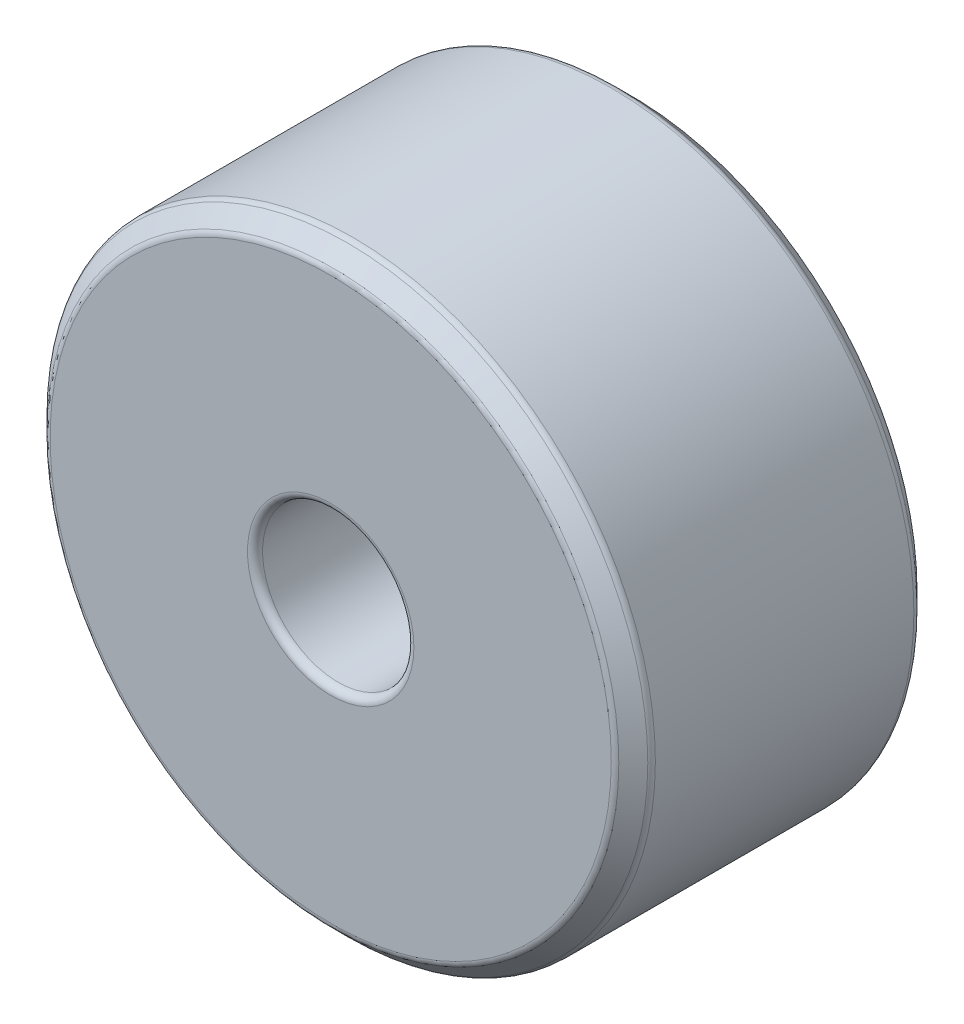
ISO-10303-21;
HEADER;
FILE_DESCRIPTION(('STEP AP214'),'2;1');
FILE_NAME('part.step','',(''),(''),'','','');
FILE_SCHEMA(('AUTOMOTIVE_DESIGN { 1 0 10303 214 1 1 1 1 }'));
ENDSEC;
DATA;
#1=APPLICATION_CONTEXT('core data for automotive mechanical design processes');
#2=APPLICATION_PROTOCOL_DEFINITION('international standard','automotive_design',2000,#1);
#3=PRODUCT_CONTEXT('',#1,'mechanical');
#4=PRODUCT('Part','Part','',(#3));
#5=PRODUCT_RELATED_PRODUCT_CATEGORY('part','',(#4));
#6=PRODUCT_DEFINITION_FORMATION('','',#4);
#7=PRODUCT_DEFINITION_CONTEXT('part definition',#1,'design');
#8=PRODUCT_DEFINITION('design','',#6,#7);
#9=PRODUCT_DEFINITION_SHAPE('','',#8);
#10=(LENGTH_UNIT() NAMED_UNIT(*) SI_UNIT(.MILLI.,.METRE.));
#11=(NAMED_UNIT(*) PLANE_ANGLE_UNIT() SI_UNIT($,.RADIAN.));
#12=(NAMED_UNIT(*) SI_UNIT($,.STERADIAN.) SOLID_ANGLE_UNIT());
#13=UNCERTAINTY_MEASURE_WITH_UNIT(LENGTH_MEASURE(1.E-05),#10,'distance_accuracy_value','');
#14=(GEOMETRIC_REPRESENTATION_CONTEXT(3) GLOBAL_UNCERTAINTY_ASSIGNED_CONTEXT((#13)) GLOBAL_UNIT_ASSIGNED_CONTEXT((#10,
#11,#12)) REPRESENTATION_CONTEXT('',''));
#15=CARTESIAN_POINT('',(0.,0.,0.));
#16=DIRECTION('',(0.,0.,1.));
#17=DIRECTION('',(1.,0.,0.));
#18=AXIS2_PLACEMENT_3D('',#15,#16,#17);
#19=CARTESIAN_POINT('',(0.,0.,4.));
#20=DIRECTION('',(0.,0.,1.));
#21=DIRECTION('',(1.,0.,0.));
#22=AXIS2_PLACEMENT_3D('',#19,#20,#21);
#23=PLANE('',#22);
#24=CARTESIAN_POINT('',(0.,0.,4.));
#25=DIRECTION('',(0.,0.,1.));
#26=DIRECTION('',(1.,0.,0.));
#27=AXIS2_PLACEMENT_3D('',#24,#25,#26);
#28=CIRCLE('',#27,3.70857864376269);
#29=CARTESIAN_POINT('',(3.70857864376269,0.,4.));
#30=VERTEX_POINT('',#29);
#31=EDGE_CURVE('E52',#30,#30,#28,.T.);
#32=ORIENTED_EDGE('',*,*,#31,.T.);
#33=EDGE_LOOP('',(#32));
#34=FACE_BOUND('',#33,.T.);
#35=CARTESIAN_POINT('',(0.,0.,4.));
#36=DIRECTION('',(0.,0.,1.));
#37=DIRECTION('',(1.,0.,0.));
#38=AXIS2_PLACEMENT_3D('',#35,#36,#37);
#39=CIRCLE('',#38,1.1);
#40=CARTESIAN_POINT('',(1.1,0.,4.));
#41=VERTEX_POINT('',#40);
#42=EDGE_CURVE('E55',#41,#41,#39,.F.);
#43=ORIENTED_EDGE('',*,*,#42,.T.);
#44=EDGE_LOOP('',(#43));
#45=FACE_BOUND('',#44,.T.);
#46=ADVANCED_FACE('F32',(#34,#45),#23,.T.);
#47=CARTESIAN_POINT('',(0.,0.,0.));
#48=DIRECTION('',(0.,0.,1.));
#49=DIRECTION('',(1.,0.,0.));
#50=AXIS2_PLACEMENT_3D('',#47,#48,#49);
#51=PLANE('',#50);
#52=CARTESIAN_POINT('',(0.,0.,0.));
#53=DIRECTION('',(0.,0.,1.));
#54=DIRECTION('',(1.,0.,0.));
#55=AXIS2_PLACEMENT_3D('',#52,#53,#54);
#56=CIRCLE('',#55,3.70857864376269);
#57=CARTESIAN_POINT('',(3.70857864376269,0.,0.));
#58=VERTEX_POINT('',#57);
#59=EDGE_CURVE('E70',#58,#58,#56,.F.);
#60=ORIENTED_EDGE('',*,*,#59,.T.);
#61=EDGE_LOOP('',(#60));
#62=FACE_BOUND('',#61,.T.);
#63=CARTESIAN_POINT('',(0.,0.,0.));
#64=DIRECTION('',(0.,0.,1.));
#65=DIRECTION('',(1.,0.,0.));
#66=AXIS2_PLACEMENT_3D('',#63,#64,#65);
#67=CIRCLE('',#66,1.1);
#68=CARTESIAN_POINT('',(1.1,0.,0.));
#69=VERTEX_POINT('',#68);
#70=EDGE_CURVE('E73',#69,#69,#67,.T.);
#71=ORIENTED_EDGE('',*,*,#70,.T.);
#72=EDGE_LOOP('',(#71));
#73=FACE_BOUND('',#72,.T.);
#74=ADVANCED_FACE('F77',(#62,#73),#51,.F.);
#75=CARTESIAN_POINT('',(0.,0.,4.));
#76=DIRECTION('',(0.,0.,-1.));
#77=DIRECTION('',(-1.,0.,0.));
#78=AXIS2_PLACEMENT_3D('',#75,#76,#77);
#79=CYLINDRICAL_SURFACE('',#78,4.);
#80=CARTESIAN_POINT('',(0.,0.,0.291421356237313));
#81=DIRECTION('',(0.,0.,-1.));
#82=DIRECTION('',(-1.,0.,0.));
#83=AXIS2_PLACEMENT_3D('',#80,#81,#82);
#84=CIRCLE('',#83,4.);
#85=CARTESIAN_POINT('',(-4.,0.,0.291421356237313));
#86=VERTEX_POINT('',#85);
#87=EDGE_CURVE('E58',#86,#86,#84,.F.);
#88=ORIENTED_EDGE('',*,*,#87,.T.);
#89=EDGE_LOOP('',(#88));
#90=FACE_BOUND('',#89,.T.);
#91=CARTESIAN_POINT('',(0.,0.,3.70857864376269));
#92=DIRECTION('',(0.,0.,1.));
#93=DIRECTION('',(1.,0.,0.));
#94=AXIS2_PLACEMENT_3D('',#91,#92,#93);
#95=CIRCLE('',#94,4.);
#96=CARTESIAN_POINT('',(4.,0.,3.70857864376269));
#97=VERTEX_POINT('',#96);
#98=EDGE_CURVE('E61',#97,#97,#95,.F.);
#99=ORIENTED_EDGE('',*,*,#98,.T.);
#100=EDGE_LOOP('',(#99));
#101=FACE_BOUND('',#100,.T.);
#102=ADVANCED_FACE('F97',(#90,#101),#79,.T.);
#103=CARTESIAN_POINT('',(0.,0.,4.));
#104=DIRECTION('',(0.,0.,-1.));
#105=DIRECTION('',(-1.,0.,0.));
#106=AXIS2_PLACEMENT_3D('',#103,#104,#105);
#107=CYLINDRICAL_SURFACE('',#106,1.);
#108=CARTESIAN_POINT('',(0.,0.,0.0999999999999998));
#109=DIRECTION('',(0.,0.,1.));
#110=DIRECTION('',(1.,0.,0.));
#111=AXIS2_PLACEMENT_3D('',#108,#109,#110);
#112=CIRCLE('',#111,1.);
#113=CARTESIAN_POINT('',(1.,0.,0.0999999999999998));
#114=VERTEX_POINT('',#113);
#115=EDGE_CURVE('E10',#114,#114,#112,.F.);
#116=ORIENTED_EDGE('',*,*,#115,.T.);
#117=EDGE_LOOP('',(#116));
#118=FACE_BOUND('',#117,.T.);
#119=CARTESIAN_POINT('',(0.,0.,3.9));
#120=DIRECTION('',(0.,0.,1.));
#121=DIRECTION('',(1.,0.,0.));
#122=AXIS2_PLACEMENT_3D('',#119,#120,#121);
#123=CIRCLE('',#122,1.);
#124=CARTESIAN_POINT('',(1.,0.,3.9));
#125=VERTEX_POINT('',#124);
#126=EDGE_CURVE('E39',#125,#125,#123,.T.);
#127=ORIENTED_EDGE('',*,*,#126,.T.);
#128=EDGE_LOOP('',(#127));
#129=FACE_BOUND('',#128,.T.);
#130=ADVANCED_FACE('F102',(#118,#129),#107,.F.);
#131=CARTESIAN_POINT('',(0.,0.,0.250000000000003));
#132=DIRECTION('',(0.,0.,1.));
#133=DIRECTION('',(1.,0.,0.));
#134=AXIS2_PLACEMENT_3D('',#131,#132,#133);
#135=CONICAL_SURFACE('',#134,4.,0.78539816339745);
#136=CARTESIAN_POINT('',(0.,0.,0.0292893218813441));
#137=DIRECTION('',(0.,0.,1.));
#138=DIRECTION('',(1.,0.,0.));
#139=AXIS2_PLACEMENT_3D('',#136,#137,#138);
#140=CIRCLE('',#139,3.77928932188134);
#141=CARTESIAN_POINT('',(3.77928932188134,0.,0.0292893218813441));
#142=VERTEX_POINT('',#141);
#143=EDGE_CURVE('E64',#142,#142,#140,.T.);
#144=ORIENTED_EDGE('',*,*,#143,.T.);
#145=EDGE_LOOP('',(#144));
#146=FACE_BOUND('',#145,.T.);
#147=CARTESIAN_POINT('',(0.,0.,0.220710678118658));
#148=DIRECTION('',(0.,0.,1.));
#149=DIRECTION('',(1.,0.,0.));
#150=AXIS2_PLACEMENT_3D('',#147,#148,#149);
#151=CIRCLE('',#150,3.97071067811865);
#152=CARTESIAN_POINT('',(3.97071067811865,0.,0.220710678118658));
#153=VERTEX_POINT('',#152);
#154=EDGE_CURVE('E67',#153,#153,#151,.F.);
#155=ORIENTED_EDGE('',*,*,#154,.T.);
#156=EDGE_LOOP('',(#155));
#157=FACE_BOUND('',#156,.T.);
#158=ADVANCED_FACE('F107',(#146,#157),#135,.T.);
#159=CARTESIAN_POINT('',(0.,0.,4.));
#160=DIRECTION('',(0.,0.,-1.));
#161=DIRECTION('',(-1.,0.,0.));
#162=AXIS2_PLACEMENT_3D('',#159,#160,#161);
#163=CONICAL_SURFACE('',#162,3.75,0.785398163397441);
#164=CARTESIAN_POINT('',(0.,0.,3.97071067811865));
#165=DIRECTION('',(0.,0.,1.));
#166=DIRECTION('',(1.,0.,0.));
#167=AXIS2_PLACEMENT_3D('',#164,#165,#166);
#168=CIRCLE('',#167,3.77928932188135);
#169=CARTESIAN_POINT('',(3.77928932188135,0.,3.97071067811865));
#170=VERTEX_POINT('',#169);
#171=EDGE_CURVE('E43',#170,#170,#168,.F.);
#172=ORIENTED_EDGE('',*,*,#171,.T.);
#173=EDGE_LOOP('',(#172));
#174=FACE_BOUND('',#173,.T.);
#175=CARTESIAN_POINT('',(0.,0.,3.77928932188134));
#176=DIRECTION('',(0.,0.,-1.));
#177=DIRECTION('',(-1.,0.,0.));
#178=AXIS2_PLACEMENT_3D('',#175,#176,#177);
#179=CIRCLE('',#178,3.97071067811866);
#180=CARTESIAN_POINT('',(-3.97071067811866,0.,3.77928932188134));
#181=VERTEX_POINT('',#180);
#182=EDGE_CURVE('E47',#181,#181,#179,.F.);
#183=ORIENTED_EDGE('',*,*,#182,.T.);
#184=EDGE_LOOP('',(#183));
#185=FACE_BOUND('',#184,.T.);
#186=ADVANCED_FACE('F110',(#174,#185),#163,.T.);
#187=CARTESIAN_POINT('',(0.,0.,0.1));
#188=DIRECTION('',(0.,0.,1.));
#189=DIRECTION('',(1.,0.,0.));
#190=AXIS2_PLACEMENT_3D('',#187,#188,#189);
#191=TOROIDAL_SURFACE('',#190,3.70857864376269,0.1);
#192=ORIENTED_EDGE('',*,*,#143,.F.);
#193=EDGE_LOOP('',(#192));
#194=FACE_BOUND('',#193,.T.);
#195=ORIENTED_EDGE('',*,*,#59,.F.);
#196=EDGE_LOOP('',(#195));
#197=FACE_BOUND('',#196,.T.);
#198=ADVANCED_FACE('F114',(#194,#197),#191,.T.);
#199=CARTESIAN_POINT('',(0.,0.,0.291421356237313));
#200=DIRECTION('',(0.,0.,-1.));
#201=DIRECTION('',(-1.,0.,0.));
#202=AXIS2_PLACEMENT_3D('',#199,#200,#201);
#203=TOROIDAL_SURFACE('',#202,3.9,0.1);
#204=ORIENTED_EDGE('',*,*,#154,.F.);
#205=EDGE_LOOP('',(#204));
#206=FACE_BOUND('',#205,.T.);
#207=ORIENTED_EDGE('',*,*,#87,.F.);
#208=EDGE_LOOP('',(#207));
#209=FACE_BOUND('',#208,.T.);
#210=ADVANCED_FACE('F118',(#206,#209),#203,.T.);
#211=CARTESIAN_POINT('',(0.,0.,3.9));
#212=DIRECTION('',(0.,0.,1.));
#213=DIRECTION('',(1.,0.,0.));
#214=AXIS2_PLACEMENT_3D('',#211,#212,#213);
#215=TOROIDAL_SURFACE('',#214,3.70857864376269,0.1);
#216=ORIENTED_EDGE('',*,*,#171,.F.);
#217=EDGE_LOOP('',(#216));
#218=FACE_BOUND('',#217,.T.);
#219=ORIENTED_EDGE('',*,*,#31,.F.);
#220=EDGE_LOOP('',(#219));
#221=FACE_BOUND('',#220,.T.);
#222=ADVANCED_FACE('F88',(#218,#221),#215,.T.);
#223=CARTESIAN_POINT('',(0.,0.,3.70857864376269));
#224=DIRECTION('',(0.,0.,1.));
#225=DIRECTION('',(1.,0.,0.));
#226=AXIS2_PLACEMENT_3D('',#223,#224,#225);
#227=TOROIDAL_SURFACE('',#226,3.9,0.1);
#228=ORIENTED_EDGE('',*,*,#182,.F.);
#229=EDGE_LOOP('',(#228));
#230=FACE_BOUND('',#229,.T.);
#231=ORIENTED_EDGE('',*,*,#98,.F.);
#232=EDGE_LOOP('',(#231));
#233=FACE_BOUND('',#232,.T.);
#234=ADVANCED_FACE('F81',(#230,#233),#227,.T.);
#235=CARTESIAN_POINT('',(0.,0.,0.0999999999999998));
#236=DIRECTION('',(0.,0.,1.));
#237=DIRECTION('',(1.,0.,0.));
#238=AXIS2_PLACEMENT_3D('',#235,#236,#237);
#239=TOROIDAL_SURFACE('',#238,1.1,0.1);
#240=ORIENTED_EDGE('',*,*,#115,.F.);
#241=EDGE_LOOP('',(#240));
#242=FACE_BOUND('',#241,.T.);
#243=ORIENTED_EDGE('',*,*,#70,.F.);
#244=EDGE_LOOP('',(#243));
#245=FACE_BOUND('',#244,.T.);
#246=ADVANCED_FACE('F79',(#242,#245),#239,.T.);
#247=CARTESIAN_POINT('',(0.,0.,3.9));
#248=DIRECTION('',(0.,0.,1.));
#249=DIRECTION('',(1.,0.,0.));
#250=AXIS2_PLACEMENT_3D('',#247,#248,#249);
#251=TOROIDAL_SURFACE('',#250,1.1,0.1);
#252=ORIENTED_EDGE('',*,*,#42,.F.);
#253=EDGE_LOOP('',(#252));
#254=FACE_BOUND('',#253,.T.);
#255=ORIENTED_EDGE('',*,*,#126,.F.);
#256=EDGE_LOOP('',(#255));
#257=FACE_BOUND('',#256,.T.);
#258=ADVANCED_FACE('F34',(#254,#257),#251,.T.);
#259=CLOSED_SHELL('',(#46,#74,#102,#130,#158,#186,#198,#210,#222,#234,#246,#258));
#260=MANIFOLD_SOLID_BREP('B2',#259);
#261=ADVANCED_BREP_SHAPE_REPRESENTATION('',(#18,#260),#14);
#262=SHAPE_DEFINITION_REPRESENTATION(#9,#261);
ENDSEC;
END-ISO-10303-21;
